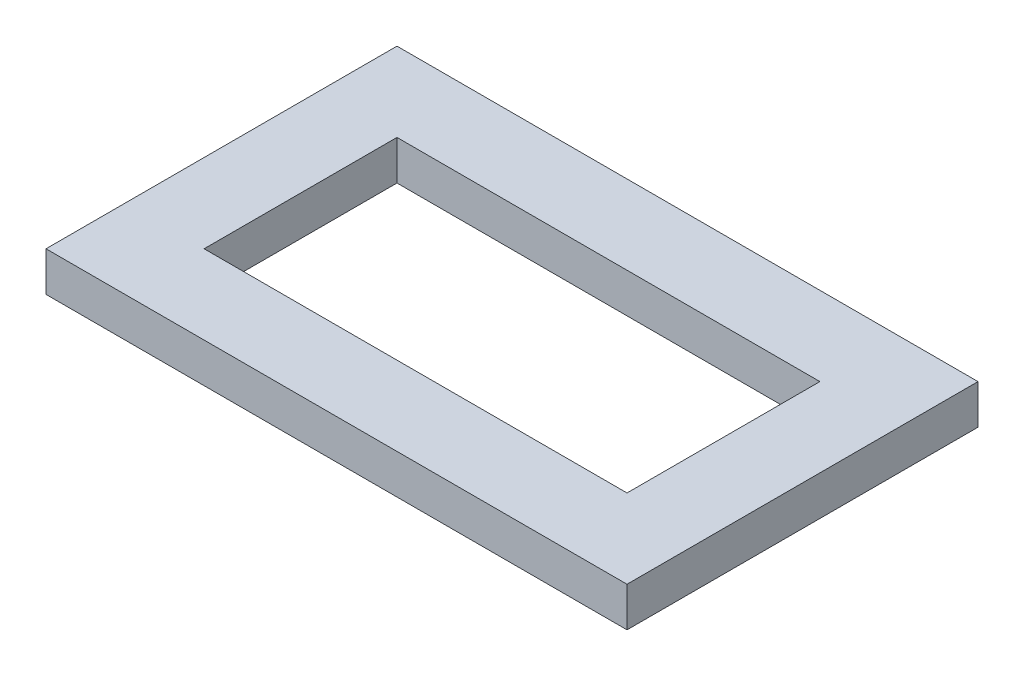
ISO-10303-21;
HEADER;
FILE_DESCRIPTION(('STEP AP214'),'2;1');
FILE_NAME('part.step','',(''),(''),'','','');
FILE_SCHEMA(('AUTOMOTIVE_DESIGN { 1 0 10303 214 1 1 1 1 }'));
ENDSEC;
DATA;
#1=APPLICATION_CONTEXT('core data for automotive mechanical design processes');
#2=APPLICATION_PROTOCOL_DEFINITION('international standard','automotive_design',2000,#1);
#3=PRODUCT_CONTEXT('',#1,'mechanical');
#4=PRODUCT('Part','Part','',(#3));
#5=PRODUCT_RELATED_PRODUCT_CATEGORY('part','',(#4));
#6=PRODUCT_DEFINITION_FORMATION('','',#4);
#7=PRODUCT_DEFINITION_CONTEXT('part definition',#1,'design');
#8=PRODUCT_DEFINITION('design','',#6,#7);
#9=PRODUCT_DEFINITION_SHAPE('','',#8);
#10=(LENGTH_UNIT() NAMED_UNIT(*) SI_UNIT(.MILLI.,.METRE.));
#11=(NAMED_UNIT(*) PLANE_ANGLE_UNIT() SI_UNIT($,.RADIAN.));
#12=(NAMED_UNIT(*) SI_UNIT($,.STERADIAN.) SOLID_ANGLE_UNIT());
#13=UNCERTAINTY_MEASURE_WITH_UNIT(LENGTH_MEASURE(1.E-05),#10,'distance_accuracy_value','');
#14=(GEOMETRIC_REPRESENTATION_CONTEXT(3) GLOBAL_UNCERTAINTY_ASSIGNED_CONTEXT((#13)) GLOBAL_UNIT_ASSIGNED_CONTEXT((#10,
#11,#12)) REPRESENTATION_CONTEXT('',''));
#15=CARTESIAN_POINT('',(0.,0.,0.));
#16=DIRECTION('',(0.,0.,1.));
#17=DIRECTION('',(1.,0.,0.));
#18=AXIS2_PLACEMENT_3D('',#15,#16,#17);
#19=CARTESIAN_POINT('',(-5.,2.5,5.));
#20=DIRECTION('',(0.,0.,-1.));
#21=DIRECTION('',(-1.,0.,0.));
#22=AXIS2_PLACEMENT_3D('',#19,#20,#21);
#23=PLANE('',#22);
#24=DIRECTION('',(1.,0.,0.));
#25=VECTOR('',#24,1.);
#26=CARTESIAN_POINT('',(-5.,0.,5.));
#27=LINE('',#26,#25);
#28=CARTESIAN_POINT('',(-5.,0.,5.));
#29=VERTEX_POINT('',#28);
#30=CARTESIAN_POINT('',(31.75,0.,5.));
#31=VERTEX_POINT('',#30);
#32=EDGE_CURVE('E174',#29,#31,#27,.T.);
#33=ORIENTED_EDGE('',*,*,#32,.T.);
#34=DIRECTION('',(0.,-1.,0.));
#35=VECTOR('',#34,1.);
#36=CARTESIAN_POINT('',(31.75,2.5,5.));
#37=LINE('',#36,#35);
#38=CARTESIAN_POINT('',(31.75,2.5,5.));
#39=VERTEX_POINT('',#38);
#40=EDGE_CURVE('E12',#39,#31,#37,.T.);
#41=ORIENTED_EDGE('',*,*,#40,.F.);
#42=DIRECTION('',(1.,0.,0.));
#43=VECTOR('',#42,1.);
#44=CARTESIAN_POINT('',(-5.,2.5,5.));
#45=LINE('',#44,#43);
#46=CARTESIAN_POINT('',(-5.,2.5,5.));
#47=VERTEX_POINT('',#46);
#48=EDGE_CURVE('E180',#47,#39,#45,.T.);
#49=ORIENTED_EDGE('',*,*,#48,.F.);
#50=DIRECTION('',(0.,-1.,0.));
#51=VECTOR('',#50,1.);
#52=CARTESIAN_POINT('',(-5.,2.5,5.));
#53=LINE('',#52,#51);
#54=EDGE_CURVE('E196',#47,#29,#53,.T.);
#55=ORIENTED_EDGE('',*,*,#54,.T.);
#56=EDGE_LOOP('',(#33,#41,#49,#55));
#57=FACE_BOUND('',#56,.T.);
#58=ADVANCED_FACE('F67',(#57),#23,.F.);
#59=CARTESIAN_POINT('',(31.75,2.5,5.));
#60=DIRECTION('',(-1.,0.,0.));
#61=DIRECTION('',(0.,0.,1.));
#62=AXIS2_PLACEMENT_3D('',#59,#60,#61);
#63=PLANE('',#62);
#64=DIRECTION('',(0.,0.,-1.));
#65=VECTOR('',#64,1.);
#66=CARTESIAN_POINT('',(31.75,0.,5.));
#67=LINE('',#66,#65);
#68=CARTESIAN_POINT('',(31.75,0.,-17.2));
#69=VERTEX_POINT('',#68);
#70=EDGE_CURVE('E200',#31,#69,#67,.T.);
#71=ORIENTED_EDGE('',*,*,#70,.T.);
#72=DIRECTION('',(0.,-1.,0.));
#73=VECTOR('',#72,1.);
#74=CARTESIAN_POINT('',(31.75,2.5,-17.2));
#75=LINE('',#74,#73);
#76=CARTESIAN_POINT('',(31.75,2.5,-17.2));
#77=VERTEX_POINT('',#76);
#78=EDGE_CURVE('E75',#77,#69,#75,.T.);
#79=ORIENTED_EDGE('',*,*,#78,.F.);
#80=DIRECTION('',(0.,0.,-1.));
#81=VECTOR('',#80,1.);
#82=CARTESIAN_POINT('',(31.75,2.5,5.));
#83=LINE('',#82,#81);
#84=EDGE_CURVE('E184',#39,#77,#83,.T.);
#85=ORIENTED_EDGE('',*,*,#84,.F.);
#86=ORIENTED_EDGE('',*,*,#40,.T.);
#87=EDGE_LOOP('',(#71,#79,#85,#86));
#88=FACE_BOUND('',#87,.T.);
#89=ADVANCED_FACE('F222',(#88),#63,.F.);
#90=CARTESIAN_POINT('',(-5.,2.5,-17.2));
#91=DIRECTION('',(0.,0.,-1.));
#92=DIRECTION('',(-1.,0.,0.));
#93=AXIS2_PLACEMENT_3D('',#90,#91,#92);
#94=PLANE('',#93);
#95=DIRECTION('',(1.,0.,0.));
#96=VECTOR('',#95,1.);
#97=CARTESIAN_POINT('',(-5.,0.,-17.2));
#98=LINE('',#97,#96);
#99=CARTESIAN_POINT('',(-5.,0.,-17.2));
#100=VERTEX_POINT('',#99);
#101=EDGE_CURVE('E204',#100,#69,#98,.T.);
#102=ORIENTED_EDGE('',*,*,#101,.F.);
#103=DIRECTION('',(0.,-1.,0.));
#104=VECTOR('',#103,1.);
#105=CARTESIAN_POINT('',(-5.,2.5,-17.2));
#106=LINE('',#105,#104);
#107=CARTESIAN_POINT('',(-5.,2.5,-17.2));
#108=VERTEX_POINT('',#107);
#109=EDGE_CURVE('E213',#108,#100,#106,.T.);
#110=ORIENTED_EDGE('',*,*,#109,.F.);
#111=DIRECTION('',(1.,0.,0.));
#112=VECTOR('',#111,1.);
#113=CARTESIAN_POINT('',(-5.,2.5,-17.2));
#114=LINE('',#113,#112);
#115=EDGE_CURVE('E188',#108,#77,#114,.T.);
#116=ORIENTED_EDGE('',*,*,#115,.T.);
#117=ORIENTED_EDGE('',*,*,#78,.T.);
#118=EDGE_LOOP('',(#102,#110,#116,#117));
#119=FACE_BOUND('',#118,.T.);
#120=ADVANCED_FACE('F219',(#119),#94,.T.);
#121=CARTESIAN_POINT('',(-5.,2.5,5.));
#122=DIRECTION('',(-1.,0.,0.));
#123=DIRECTION('',(0.,0.,1.));
#124=AXIS2_PLACEMENT_3D('',#121,#122,#123);
#125=PLANE('',#124);
#126=DIRECTION('',(0.,0.,-1.));
#127=VECTOR('',#126,1.);
#128=CARTESIAN_POINT('',(-5.,0.,5.));
#129=LINE('',#128,#127);
#130=EDGE_CURVE('E185',#29,#100,#129,.T.);
#131=ORIENTED_EDGE('',*,*,#130,.F.);
#132=ORIENTED_EDGE('',*,*,#54,.F.);
#133=DIRECTION('',(0.,0.,-1.));
#134=VECTOR('',#133,1.);
#135=CARTESIAN_POINT('',(-5.,2.5,5.));
#136=LINE('',#135,#134);
#137=EDGE_CURVE('E192',#47,#108,#136,.T.);
#138=ORIENTED_EDGE('',*,*,#137,.T.);
#139=ORIENTED_EDGE('',*,*,#109,.T.);
#140=EDGE_LOOP('',(#131,#132,#138,#139));
#141=FACE_BOUND('',#140,.T.);
#142=ADVANCED_FACE('F229',(#141),#125,.T.);
#143=CARTESIAN_POINT('',(0.,2.5,0.));
#144=DIRECTION('',(0.,1.,0.));
#145=DIRECTION('',(0.,0.,1.));
#146=AXIS2_PLACEMENT_3D('',#143,#144,#145);
#147=PLANE('',#146);
#148=DIRECTION('',(1.,0.,0.));
#149=VECTOR('',#148,1.);
#150=CARTESIAN_POINT('',(0.,2.5,-12.2));
#151=LINE('',#150,#149);
#152=CARTESIAN_POINT('',(0.,2.5,-12.2));
#153=VERTEX_POINT('',#152);
#154=CARTESIAN_POINT('',(26.75,2.5,-12.2));
#155=VERTEX_POINT('',#154);
#156=EDGE_CURVE('E140',#153,#155,#151,.T.);
#157=ORIENTED_EDGE('',*,*,#156,.T.);
#158=DIRECTION('',(0.,0.,-1.));
#159=VECTOR('',#158,1.);
#160=CARTESIAN_POINT('',(26.75,2.5,0.));
#161=LINE('',#160,#159);
#162=CARTESIAN_POINT('',(26.75,2.5,0.));
#163=VERTEX_POINT('',#162);
#164=EDGE_CURVE('E131',#163,#155,#161,.T.);
#165=ORIENTED_EDGE('',*,*,#164,.F.);
#166=DIRECTION('',(1.,0.,0.));
#167=VECTOR('',#166,1.);
#168=CARTESIAN_POINT('',(0.,2.5,0.));
#169=LINE('',#168,#167);
#170=CARTESIAN_POINT('',(0.,2.5,0.));
#171=VERTEX_POINT('',#170);
#172=EDGE_CURVE('E139',#171,#163,#169,.T.);
#173=ORIENTED_EDGE('',*,*,#172,.F.);
#174=DIRECTION('',(0.,0.,-1.));
#175=VECTOR('',#174,1.);
#176=CARTESIAN_POINT('',(0.,2.5,0.));
#177=LINE('',#176,#175);
#178=EDGE_CURVE('E146',#171,#153,#177,.T.);
#179=ORIENTED_EDGE('',*,*,#178,.T.);
#180=EDGE_LOOP('',(#157,#165,#173,#179));
#181=FACE_BOUND('',#180,.T.);
#182=ORIENTED_EDGE('',*,*,#48,.T.);
#183=ORIENTED_EDGE('',*,*,#84,.T.);
#184=ORIENTED_EDGE('',*,*,#115,.F.);
#185=ORIENTED_EDGE('',*,*,#137,.F.);
#186=EDGE_LOOP('',(#182,#183,#184,#185));
#187=FACE_BOUND('',#186,.T.);
#188=ADVANCED_FACE('F148',(#181,#187),#147,.T.);
#189=CARTESIAN_POINT('',(0.,0.,0.));
#190=DIRECTION('',(0.,1.,0.));
#191=DIRECTION('',(0.,0.,1.));
#192=AXIS2_PLACEMENT_3D('',#189,#190,#191);
#193=PLANE('',#192);
#194=DIRECTION('',(0.,0.,-1.));
#195=VECTOR('',#194,1.);
#196=CARTESIAN_POINT('',(26.75,0.,0.));
#197=LINE('',#196,#195);
#198=CARTESIAN_POINT('',(26.75,0.,0.));
#199=VERTEX_POINT('',#198);
#200=CARTESIAN_POINT('',(26.75,0.,-12.2));
#201=VERTEX_POINT('',#200);
#202=EDGE_CURVE('E165',#199,#201,#197,.T.);
#203=ORIENTED_EDGE('',*,*,#202,.T.);
#204=DIRECTION('',(1.,0.,0.));
#205=VECTOR('',#204,1.);
#206=CARTESIAN_POINT('',(0.,0.,-12.2));
#207=LINE('',#206,#205);
#208=CARTESIAN_POINT('',(0.,0.,-12.2));
#209=VERTEX_POINT('',#208);
#210=EDGE_CURVE('E90',#209,#201,#207,.T.);
#211=ORIENTED_EDGE('',*,*,#210,.F.);
#212=DIRECTION('',(0.,0.,-1.));
#213=VECTOR('',#212,1.);
#214=CARTESIAN_POINT('',(0.,0.,0.));
#215=LINE('',#214,#213);
#216=CARTESIAN_POINT('',(0.,0.,0.));
#217=VERTEX_POINT('',#216);
#218=EDGE_CURVE('E152',#217,#209,#215,.T.);
#219=ORIENTED_EDGE('',*,*,#218,.F.);
#220=DIRECTION('',(1.,0.,0.));
#221=VECTOR('',#220,1.);
#222=CARTESIAN_POINT('',(0.,0.,0.));
#223=LINE('',#222,#221);
#224=EDGE_CURVE('E156',#217,#199,#223,.T.);
#225=ORIENTED_EDGE('',*,*,#224,.T.);
#226=EDGE_LOOP('',(#203,#211,#219,#225));
#227=FACE_BOUND('',#226,.T.);
#228=ORIENTED_EDGE('',*,*,#32,.F.);
#229=ORIENTED_EDGE('',*,*,#130,.T.);
#230=ORIENTED_EDGE('',*,*,#101,.T.);
#231=ORIENTED_EDGE('',*,*,#70,.F.);
#232=EDGE_LOOP('',(#228,#229,#230,#231));
#233=FACE_BOUND('',#232,.T.);
#234=ADVANCED_FACE('F226',(#227,#233),#193,.F.);
#235=CARTESIAN_POINT('',(0.,2.5,-12.2));
#236=DIRECTION('',(0.,0.,-1.));
#237=DIRECTION('',(-1.,0.,0.));
#238=AXIS2_PLACEMENT_3D('',#235,#236,#237);
#239=PLANE('',#238);
#240=ORIENTED_EDGE('',*,*,#210,.T.);
#241=DIRECTION('',(0.,-1.,0.));
#242=VECTOR('',#241,1.);
#243=CARTESIAN_POINT('',(26.75,2.5,-12.2));
#244=LINE('',#243,#242);
#245=EDGE_CURVE('E133',#155,#201,#244,.T.);
#246=ORIENTED_EDGE('',*,*,#245,.F.);
#247=ORIENTED_EDGE('',*,*,#156,.F.);
#248=DIRECTION('',(0.,-1.,0.));
#249=VECTOR('',#248,1.);
#250=CARTESIAN_POINT('',(0.,2.5,-12.2));
#251=LINE('',#250,#249);
#252=EDGE_CURVE('E171',#153,#209,#251,.T.);
#253=ORIENTED_EDGE('',*,*,#252,.T.);
#254=EDGE_LOOP('',(#240,#246,#247,#253));
#255=FACE_BOUND('',#254,.T.);
#256=ADVANCED_FACE('F143',(#255),#239,.F.);
#257=CARTESIAN_POINT('',(0.,2.5,0.));
#258=DIRECTION('',(-1.,0.,0.));
#259=DIRECTION('',(0.,0.,1.));
#260=AXIS2_PLACEMENT_3D('',#257,#258,#259);
#261=PLANE('',#260);
#262=ORIENTED_EDGE('',*,*,#218,.T.);
#263=ORIENTED_EDGE('',*,*,#252,.F.);
#264=ORIENTED_EDGE('',*,*,#178,.F.);
#265=DIRECTION('',(0.,-1.,0.));
#266=VECTOR('',#265,1.);
#267=CARTESIAN_POINT('',(0.,2.5,0.));
#268=LINE('',#267,#266);
#269=EDGE_CURVE('E175',#171,#217,#268,.T.);
#270=ORIENTED_EDGE('',*,*,#269,.T.);
#271=EDGE_LOOP('',(#262,#263,#264,#270));
#272=FACE_BOUND('',#271,.T.);
#273=ADVANCED_FACE('F251',(#272),#261,.F.);
#274=CARTESIAN_POINT('',(0.,2.5,0.));
#275=DIRECTION('',(0.,0.,-1.));
#276=DIRECTION('',(-1.,0.,0.));
#277=AXIS2_PLACEMENT_3D('',#274,#275,#276);
#278=PLANE('',#277);
#279=ORIENTED_EDGE('',*,*,#224,.F.);
#280=ORIENTED_EDGE('',*,*,#269,.F.);
#281=ORIENTED_EDGE('',*,*,#172,.T.);
#282=DIRECTION('',(0.,-1.,0.));
#283=VECTOR('',#282,1.);
#284=CARTESIAN_POINT('',(26.75,2.5,0.));
#285=LINE('',#284,#283);
#286=EDGE_CURVE('E82',#163,#199,#285,.T.);
#287=ORIENTED_EDGE('',*,*,#286,.T.);
#288=EDGE_LOOP('',(#279,#280,#281,#287));
#289=FACE_BOUND('',#288,.T.);
#290=ADVANCED_FACE('F254',(#289),#278,.T.);
#291=CARTESIAN_POINT('',(26.75,2.5,0.));
#292=DIRECTION('',(-1.,0.,0.));
#293=DIRECTION('',(0.,0.,1.));
#294=AXIS2_PLACEMENT_3D('',#291,#292,#293);
#295=PLANE('',#294);
#296=ORIENTED_EDGE('',*,*,#202,.F.);
#297=ORIENTED_EDGE('',*,*,#286,.F.);
#298=ORIENTED_EDGE('',*,*,#164,.T.);
#299=ORIENTED_EDGE('',*,*,#245,.T.);
#300=EDGE_LOOP('',(#296,#297,#298,#299));
#301=FACE_BOUND('',#300,.T.);
#302=ADVANCED_FACE('F132',(#301),#295,.T.);
#303=CLOSED_SHELL('',(#58,#89,#120,#142,#188,#234,#256,#273,#290,#302));
#304=MANIFOLD_SOLID_BREP('B2',#303);
#305=ADVANCED_BREP_SHAPE_REPRESENTATION('',(#18,#304),#14);
#306=SHAPE_DEFINITION_REPRESENTATION(#9,#305);
ENDSEC;
END-ISO-10303-21;
